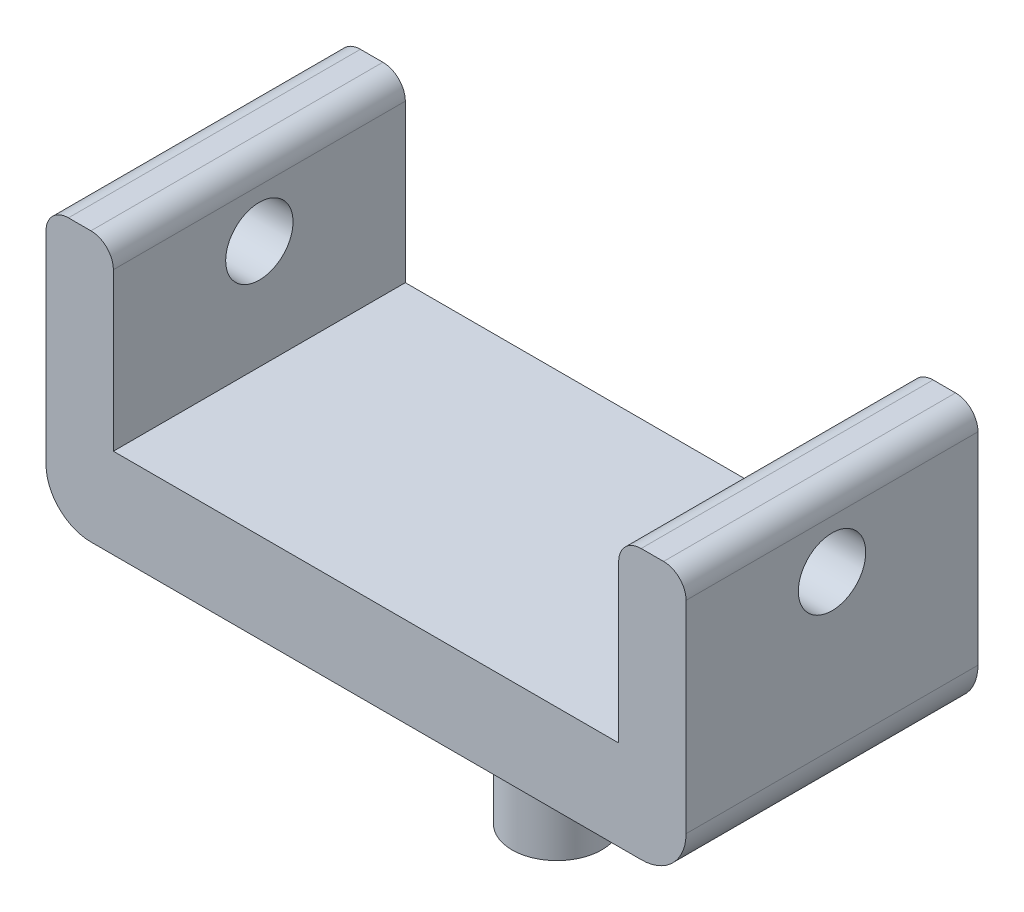
ISO-10303-21;
HEADER;
FILE_DESCRIPTION(('STEP AP214'),'2;1');
FILE_NAME('part.step','',(''),(''),'','','');
FILE_SCHEMA(('AUTOMOTIVE_DESIGN { 1 0 10303 214 1 1 1 1 }'));
ENDSEC;
DATA;
#1=APPLICATION_CONTEXT('core data for automotive mechanical design processes');
#2=APPLICATION_PROTOCOL_DEFINITION('international standard','automotive_design',2000,#1);
#3=PRODUCT_CONTEXT('',#1,'mechanical');
#4=PRODUCT('Part','Part','',(#3));
#5=PRODUCT_RELATED_PRODUCT_CATEGORY('part','',(#4));
#6=PRODUCT_DEFINITION_FORMATION('','',#4);
#7=PRODUCT_DEFINITION_CONTEXT('part definition',#1,'design');
#8=PRODUCT_DEFINITION('design','',#6,#7);
#9=PRODUCT_DEFINITION_SHAPE('','',#8);
#10=(LENGTH_UNIT() NAMED_UNIT(*) SI_UNIT(.MILLI.,.METRE.));
#11=(NAMED_UNIT(*) PLANE_ANGLE_UNIT() SI_UNIT($,.RADIAN.));
#12=(NAMED_UNIT(*) SI_UNIT($,.STERADIAN.) SOLID_ANGLE_UNIT());
#13=UNCERTAINTY_MEASURE_WITH_UNIT(LENGTH_MEASURE(1.E-05),#10,'distance_accuracy_value','');
#14=(GEOMETRIC_REPRESENTATION_CONTEXT(3) GLOBAL_UNCERTAINTY_ASSIGNED_CONTEXT((#13)) GLOBAL_UNIT_ASSIGNED_CONTEXT((#10,
#11,#12)) REPRESENTATION_CONTEXT('',''));
#15=CARTESIAN_POINT('',(0.,0.,0.));
#16=DIRECTION('',(0.,0.,1.));
#17=DIRECTION('',(1.,0.,0.));
#18=AXIS2_PLACEMENT_3D('',#15,#16,#17);
#19=CARTESIAN_POINT('',(0.,4.,0.));
#20=DIRECTION('',(0.,1.,0.));
#21=DIRECTION('',(0.,0.,1.));
#22=AXIS2_PLACEMENT_3D('',#19,#20,#21);
#23=PLANE('',#22);
#24=DIRECTION('',(1.,0.,0.));
#25=VECTOR('',#24,1.);
#26=CARTESIAN_POINT('',(0.,4.,-0.841162469478493));
#27=LINE('',#26,#25);
#28=CARTESIAN_POINT('',(-9.64718285128245,4.,-0.841162469478494));
#29=VERTEX_POINT('',#28);
#30=CARTESIAN_POINT('',(12.8528171487176,4.,-0.841162469478491));
#31=VERTEX_POINT('',#30);
#32=EDGE_CURVE('E266',#29,#31,#27,.T.);
#33=ORIENTED_EDGE('',*,*,#32,.F.);
#34=DIRECTION('',(0.,0.,-1.));
#35=VECTOR('',#34,1.);
#36=CARTESIAN_POINT('',(-9.64718285128245,4.,-4.84116246947849));
#37=LINE('',#36,#35);
#38=CARTESIAN_POINT('',(-9.64718285128245,4.,12.1588375305215));
#39=VERTEX_POINT('',#38);
#40=EDGE_CURVE('E214',#39,#29,#37,.T.);
#41=ORIENTED_EDGE('',*,*,#40,.F.);
#42=DIRECTION('',(1.,0.,0.));
#43=VECTOR('',#42,1.);
#44=CARTESIAN_POINT('',(-12.6471828512824,4.,12.1588375305215));
#45=LINE('',#44,#43);
#46=CARTESIAN_POINT('',(12.8528171487176,4.,12.1588375305215));
#47=VERTEX_POINT('',#46);
#48=EDGE_CURVE('E202',#39,#47,#45,.T.);
#49=ORIENTED_EDGE('',*,*,#48,.T.);
#50=DIRECTION('',(0.,0.,1.));
#51=VECTOR('',#50,1.);
#52=CARTESIAN_POINT('',(12.8528171487176,4.,-4.84116246947849));
#53=LINE('',#52,#51);
#54=EDGE_CURVE('E211',#31,#47,#53,.T.);
#55=ORIENTED_EDGE('',*,*,#54,.F.);
#56=EDGE_LOOP('',(#33,#41,#49,#55));
#57=FACE_BOUND('',#56,.T.);
#58=ADVANCED_FACE('F35',(#57),#23,.T.);
#59=CARTESIAN_POINT('',(-12.6471828512824,4.,-4.84116246947849));
#60=DIRECTION('',(1.,0.,0.));
#61=DIRECTION('',(0.,0.,-1.));
#62=AXIS2_PLACEMENT_3D('',#59,#60,#61);
#63=PLANE('',#62);
#64=CARTESIAN_POINT('',(-12.6471828512824,8.85,5.65883753052151));
#65=DIRECTION('',(-1.,0.,0.));
#66=DIRECTION('',(0.,0.,1.));
#67=AXIS2_PLACEMENT_3D('',#64,#65,#66);
#68=CIRCLE('',#67,1.5);
#69=CARTESIAN_POINT('',(-12.6471828512824,8.85,7.15883753052151));
#70=VERTEX_POINT('',#69);
#71=EDGE_CURVE('E277',#70,#70,#68,.T.);
#72=ORIENTED_EDGE('',*,*,#71,.F.);
#73=EDGE_LOOP('',(#72));
#74=FACE_BOUND('',#73,.T.);
#75=DIRECTION('',(0.,0.,1.));
#76=VECTOR('',#75,1.);
#77=CARTESIAN_POINT('',(-12.6471828512824,11.,-4.84116246947849));
#78=LINE('',#77,#76);
#79=CARTESIAN_POINT('',(-12.6471828512824,11.,12.1588375305215));
#80=VERTEX_POINT('',#79);
#81=CARTESIAN_POINT('',(-12.6471828512824,11.,-0.841162469478494));
#82=VERTEX_POINT('',#81);
#83=EDGE_CURVE('E172',#80,#82,#78,.F.);
#84=ORIENTED_EDGE('',*,*,#83,.T.);
#85=DIRECTION('',(0.,-1.,0.));
#86=VECTOR('',#85,1.);
#87=CARTESIAN_POINT('',(-12.6471828512824,4.,-0.841162469478495));
#88=LINE('',#87,#86);
#89=CARTESIAN_POINT('',(-12.6471828512824,2.,-0.841162469478495));
#90=VERTEX_POINT('',#89);
#91=EDGE_CURVE('E140',#82,#90,#88,.T.);
#92=ORIENTED_EDGE('',*,*,#91,.T.);
#93=DIRECTION('',(0.,0.,1.));
#94=VECTOR('',#93,1.);
#95=CARTESIAN_POINT('',(-12.6471828512824,2.,-4.84116246947849));
#96=LINE('',#95,#94);
#97=CARTESIAN_POINT('',(-12.6471828512824,2.,12.1588375305215));
#98=VERTEX_POINT('',#97);
#99=EDGE_CURVE('E243',#90,#98,#96,.T.);
#100=ORIENTED_EDGE('',*,*,#99,.T.);
#101=DIRECTION('',(0.,-1.,0.));
#102=VECTOR('',#101,1.);
#103=CARTESIAN_POINT('',(-12.6471828512824,4.,12.1588375305215));
#104=LINE('',#103,#102);
#105=EDGE_CURVE('E201',#80,#98,#104,.T.);
#106=ORIENTED_EDGE('',*,*,#105,.F.);
#107=EDGE_LOOP('',(#84,#92,#100,#106));
#108=FACE_BOUND('',#107,.T.);
#109=ADVANCED_FACE('F285',(#74,#108),#63,.F.);
#110=CARTESIAN_POINT('',(-12.6471828512824,4.,12.1588375305215));
#111=DIRECTION('',(0.,0.,-1.));
#112=DIRECTION('',(-1.,0.,0.));
#113=AXIS2_PLACEMENT_3D('',#110,#111,#112);
#114=PLANE('',#113);
#115=DIRECTION('',(1.,0.,0.));
#116=VECTOR('',#115,1.);
#117=CARTESIAN_POINT('',(-12.6471828512824,12.,12.1588375305215));
#118=LINE('',#117,#116);
#119=CARTESIAN_POINT('',(-11.6471828512824,12.,12.1588375305215));
#120=VERTEX_POINT('',#119);
#121=CARTESIAN_POINT('',(-10.6471828512824,12.,12.1588375305215));
#122=VERTEX_POINT('',#121);
#123=EDGE_CURVE('E221',#120,#122,#118,.T.);
#124=ORIENTED_EDGE('',*,*,#123,.F.);
#125=CARTESIAN_POINT('',(-11.6471828512824,11.,12.1588375305215));
#126=DIRECTION('',(0.,0.,-1.));
#127=DIRECTION('',(-1.,0.,0.));
#128=AXIS2_PLACEMENT_3D('',#125,#126,#127);
#129=CIRCLE('',#128,1.);
#130=EDGE_CURVE('E158',#120,#80,#129,.F.);
#131=ORIENTED_EDGE('',*,*,#130,.T.);
#132=ORIENTED_EDGE('',*,*,#105,.T.);
#133=CARTESIAN_POINT('',(-10.6471828512824,2.,12.1588375305215));
#134=DIRECTION('',(0.,0.,-1.));
#135=DIRECTION('',(-1.,0.,0.));
#136=AXIS2_PLACEMENT_3D('',#133,#134,#135);
#137=CIRCLE('',#136,2.);
#138=CARTESIAN_POINT('',(-10.6471828512824,0.,12.1588375305215));
#139=VERTEX_POINT('',#138);
#140=EDGE_CURVE('E246',#98,#139,#137,.F.);
#141=ORIENTED_EDGE('',*,*,#140,.T.);
#142=DIRECTION('',(1.,0.,0.));
#143=VECTOR('',#142,1.);
#144=CARTESIAN_POINT('',(-12.6471828512824,0.,12.1588375305215));
#145=LINE('',#144,#143);
#146=CARTESIAN_POINT('',(13.8528171487176,0.,12.1588375305215));
#147=VERTEX_POINT('',#146);
#148=EDGE_CURVE('E227',#139,#147,#145,.T.);
#149=ORIENTED_EDGE('',*,*,#148,.T.);
#150=CARTESIAN_POINT('',(13.8528171487176,2.,12.1588375305215));
#151=DIRECTION('',(0.,0.,-1.));
#152=DIRECTION('',(-1.,0.,0.));
#153=AXIS2_PLACEMENT_3D('',#150,#151,#152);
#154=CIRCLE('',#153,2.);
#155=CARTESIAN_POINT('',(15.8528171487176,2.,12.1588375305215));
#156=VERTEX_POINT('',#155);
#157=EDGE_CURVE('E199',#147,#156,#154,.F.);
#158=ORIENTED_EDGE('',*,*,#157,.T.);
#159=DIRECTION('',(0.,-1.,0.));
#160=VECTOR('',#159,1.);
#161=CARTESIAN_POINT('',(15.8528171487176,4.,12.1588375305215));
#162=LINE('',#161,#160);
#163=CARTESIAN_POINT('',(15.8528171487176,11.,12.1588375305215));
#164=VERTEX_POINT('',#163);
#165=EDGE_CURVE('E189',#164,#156,#162,.T.);
#166=ORIENTED_EDGE('',*,*,#165,.F.);
#167=CARTESIAN_POINT('',(14.8528171487176,11.,12.1588375305215));
#168=DIRECTION('',(0.,0.,-1.));
#169=DIRECTION('',(-1.,0.,0.));
#170=AXIS2_PLACEMENT_3D('',#167,#168,#169);
#171=CIRCLE('',#170,1.);
#172=CARTESIAN_POINT('',(14.8528171487176,12.,12.1588375305215));
#173=VERTEX_POINT('',#172);
#174=EDGE_CURVE('E160',#164,#173,#171,.F.);
#175=ORIENTED_EDGE('',*,*,#174,.T.);
#176=DIRECTION('',(1.,0.,0.));
#177=VECTOR('',#176,1.);
#178=CARTESIAN_POINT('',(15.8528171487176,12.,12.1588375305215));
#179=LINE('',#178,#177);
#180=CARTESIAN_POINT('',(13.8528171487176,12.,12.1588375305215));
#181=VERTEX_POINT('',#180);
#182=EDGE_CURVE('E208',#181,#173,#179,.T.);
#183=ORIENTED_EDGE('',*,*,#182,.F.);
#184=CARTESIAN_POINT('',(13.8528171487176,11.,12.1588375305215));
#185=DIRECTION('',(0.,0.,-1.));
#186=DIRECTION('',(-1.,0.,0.));
#187=AXIS2_PLACEMENT_3D('',#184,#185,#186);
#188=CIRCLE('',#187,1.);
#189=CARTESIAN_POINT('',(12.8528171487176,11.,12.1588375305215));
#190=VERTEX_POINT('',#189);
#191=EDGE_CURVE('E162',#181,#190,#188,.F.);
#192=ORIENTED_EDGE('',*,*,#191,.T.);
#193=DIRECTION('',(0.,-1.,0.));
#194=VECTOR('',#193,1.);
#195=CARTESIAN_POINT('',(12.8528171487176,12.,12.1588375305215));
#196=LINE('',#195,#194);
#197=EDGE_CURVE('E210',#190,#47,#196,.T.);
#198=ORIENTED_EDGE('',*,*,#197,.T.);
#199=ORIENTED_EDGE('',*,*,#48,.F.);
#200=DIRECTION('',(0.,-1.,0.));
#201=VECTOR('',#200,1.);
#202=CARTESIAN_POINT('',(-9.64718285128245,12.,12.1588375305215));
#203=LINE('',#202,#201);
#204=CARTESIAN_POINT('',(-9.64718285128245,11.,12.1588375305215));
#205=VERTEX_POINT('',#204);
#206=EDGE_CURVE('E223',#205,#39,#203,.T.);
#207=ORIENTED_EDGE('',*,*,#206,.F.);
#208=CARTESIAN_POINT('',(-10.6471828512824,11.,12.1588375305215));
#209=DIRECTION('',(0.,0.,-1.));
#210=DIRECTION('',(-1.,0.,0.));
#211=AXIS2_PLACEMENT_3D('',#208,#209,#210);
#212=CIRCLE('',#211,1.);
#213=EDGE_CURVE('E169',#205,#122,#212,.F.);
#214=ORIENTED_EDGE('',*,*,#213,.T.);
#215=EDGE_LOOP('',(#124,#131,#132,#141,#149,#158,#166,#175,#183,#192,#198,#199,#207,#214));
#216=FACE_BOUND('',#215,.T.);
#217=ADVANCED_FACE('F194',(#216),#114,.F.);
#218=CARTESIAN_POINT('',(15.8528171487176,4.,-4.84116246947849));
#219=DIRECTION('',(1.,0.,0.));
#220=DIRECTION('',(0.,0.,-1.));
#221=AXIS2_PLACEMENT_3D('',#218,#219,#220);
#222=PLANE('',#221);
#223=DIRECTION('',(0.,-1.,0.));
#224=VECTOR('',#223,1.);
#225=CARTESIAN_POINT('',(15.8528171487176,4.,-0.841162469478491));
#226=LINE('',#225,#224);
#227=CARTESIAN_POINT('',(15.8528171487176,11.,-0.841162469478491));
#228=VERTEX_POINT('',#227);
#229=CARTESIAN_POINT('',(15.8528171487176,2.,-0.841162469478491));
#230=VERTEX_POINT('',#229);
#231=EDGE_CURVE('E155',#228,#230,#226,.T.);
#232=ORIENTED_EDGE('',*,*,#231,.F.);
#233=DIRECTION('',(0.,0.,-1.));
#234=VECTOR('',#233,1.);
#235=CARTESIAN_POINT('',(15.8528171487176,11.,12.1588375305215));
#236=LINE('',#235,#234);
#237=EDGE_CURVE('E43',#228,#164,#236,.F.);
#238=ORIENTED_EDGE('',*,*,#237,.T.);
#239=ORIENTED_EDGE('',*,*,#165,.T.);
#240=DIRECTION('',(0.,0.,1.));
#241=VECTOR('',#240,1.);
#242=CARTESIAN_POINT('',(15.8528171487176,2.,-4.84116246947849));
#243=LINE('',#242,#241);
#244=EDGE_CURVE('E164',#156,#230,#243,.F.);
#245=ORIENTED_EDGE('',*,*,#244,.T.);
#246=EDGE_LOOP('',(#232,#238,#239,#245));
#247=FACE_BOUND('',#246,.T.);
#248=CARTESIAN_POINT('',(15.8528171487176,8.85,5.65883753052151));
#249=DIRECTION('',(-1.,0.,0.));
#250=DIRECTION('',(0.,0.,1.));
#251=AXIS2_PLACEMENT_3D('',#248,#249,#250);
#252=CIRCLE('',#251,1.5);
#253=CARTESIAN_POINT('',(15.8528171487176,8.85,7.15883753052151));
#254=VERTEX_POINT('',#253);
#255=EDGE_CURVE('E237',#254,#254,#252,.T.);
#256=ORIENTED_EDGE('',*,*,#255,.T.);
#257=EDGE_LOOP('',(#256));
#258=FACE_BOUND('',#257,.T.);
#259=ADVANCED_FACE('F186',(#247,#258),#222,.T.);
#260=CARTESIAN_POINT('',(0.,0.,0.));
#261=DIRECTION('',(0.,1.,0.));
#262=DIRECTION('',(0.,0.,1.));
#263=AXIS2_PLACEMENT_3D('',#260,#261,#262);
#264=PLANE('',#263);
#265=CARTESIAN_POINT('',(1.60281714871756,0.,3.65883753052151));
#266=DIRECTION('',(0.,1.,0.));
#267=DIRECTION('',(0.,0.,1.));
#268=AXIS2_PLACEMENT_3D('',#265,#266,#267);
#269=CIRCLE('',#268,4.);
#270=CARTESIAN_POINT('',(1.60281714871756,0.,7.65883753052151));
#271=VERTEX_POINT('',#270);
#272=EDGE_CURVE('E240',#271,#271,#269,.T.);
#273=ORIENTED_EDGE('',*,*,#272,.T.);
#274=EDGE_LOOP('',(#273));
#275=FACE_BOUND('',#274,.T.);
#276=DIRECTION('',(0.,0.,1.));
#277=VECTOR('',#276,1.);
#278=CARTESIAN_POINT('',(-10.6471828512824,0.,0.));
#279=LINE('',#278,#277);
#280=CARTESIAN_POINT('',(-10.6471828512824,0.,-0.841162469478494));
#281=VERTEX_POINT('',#280);
#282=EDGE_CURVE('E250',#139,#281,#279,.F.);
#283=ORIENTED_EDGE('',*,*,#282,.T.);
#284=DIRECTION('',(-1.,0.,0.));
#285=VECTOR('',#284,1.);
#286=CARTESIAN_POINT('',(19.4592429780123,0.,-0.84116246947849));
#287=LINE('',#286,#285);
#288=CARTESIAN_POINT('',(13.8528171487176,0.,-0.841162469478491));
#289=VERTEX_POINT('',#288);
#290=EDGE_CURVE('E299',#289,#281,#287,.T.);
#291=ORIENTED_EDGE('',*,*,#290,.F.);
#292=DIRECTION('',(0.,0.,1.));
#293=VECTOR('',#292,1.);
#294=CARTESIAN_POINT('',(13.8528171487176,0.,12.1588375305215));
#295=LINE('',#294,#293);
#296=EDGE_CURVE('E248',#289,#147,#295,.T.);
#297=ORIENTED_EDGE('',*,*,#296,.T.);
#298=ORIENTED_EDGE('',*,*,#148,.F.);
#299=EDGE_LOOP('',(#283,#291,#297,#298));
#300=FACE_BOUND('',#299,.T.);
#301=ADVANCED_FACE('F298',(#275,#300),#264,.F.);
#302=CARTESIAN_POINT('',(-9.64718285128245,12.,-4.84116246947849));
#303=DIRECTION('',(-1.,0.,0.));
#304=DIRECTION('',(0.,0.,1.));
#305=AXIS2_PLACEMENT_3D('',#302,#303,#304);
#306=PLANE('',#305);
#307=CARTESIAN_POINT('',(-9.64718285128245,8.85,5.65883753052151));
#308=DIRECTION('',(-1.,0.,0.));
#309=DIRECTION('',(0.,0.,1.));
#310=AXIS2_PLACEMENT_3D('',#307,#308,#309);
#311=CIRCLE('',#310,1.5);
#312=CARTESIAN_POINT('',(-9.64718285128245,8.85,7.15883753052151));
#313=VERTEX_POINT('',#312);
#314=EDGE_CURVE('E216',#313,#313,#311,.T.);
#315=ORIENTED_EDGE('',*,*,#314,.T.);
#316=EDGE_LOOP('',(#315));
#317=FACE_BOUND('',#316,.T.);
#318=ORIENTED_EDGE('',*,*,#40,.T.);
#319=DIRECTION('',(0.,1.,0.));
#320=VECTOR('',#319,1.);
#321=CARTESIAN_POINT('',(-9.64718285128245,12.,-0.841162469478494));
#322=LINE('',#321,#320);
#323=CARTESIAN_POINT('',(-9.64718285128245,11.,-0.841162469478494));
#324=VERTEX_POINT('',#323);
#325=EDGE_CURVE('E268',#29,#324,#322,.T.);
#326=ORIENTED_EDGE('',*,*,#325,.T.);
#327=DIRECTION('',(0.,0.,-1.));
#328=VECTOR('',#327,1.);
#329=CARTESIAN_POINT('',(-9.64718285128245,11.,12.1588375305215));
#330=LINE('',#329,#328);
#331=EDGE_CURVE('E57',#324,#205,#330,.F.);
#332=ORIENTED_EDGE('',*,*,#331,.T.);
#333=ORIENTED_EDGE('',*,*,#206,.T.);
#334=EDGE_LOOP('',(#318,#326,#332,#333));
#335=FACE_BOUND('',#334,.T.);
#336=ADVANCED_FACE('F302',(#317,#335),#306,.F.);
#337=CARTESIAN_POINT('',(0.,12.,0.));
#338=DIRECTION('',(0.,1.,0.));
#339=DIRECTION('',(0.,0.,1.));
#340=AXIS2_PLACEMENT_3D('',#337,#338,#339);
#341=PLANE('',#340);
#342=DIRECTION('',(1.,0.,0.));
#343=VECTOR('',#342,1.);
#344=CARTESIAN_POINT('',(19.4592429780123,12.,-0.84116246947849));
#345=LINE('',#344,#343);
#346=CARTESIAN_POINT('',(-11.6471828512824,12.,-0.841162469478494));
#347=VERTEX_POINT('',#346);
#348=CARTESIAN_POINT('',(-10.6471828512824,12.,-0.841162469478494));
#349=VERTEX_POINT('',#348);
#350=EDGE_CURVE('E137',#347,#349,#345,.T.);
#351=ORIENTED_EDGE('',*,*,#350,.F.);
#352=DIRECTION('',(0.,0.,1.));
#353=VECTOR('',#352,1.);
#354=CARTESIAN_POINT('',(-11.6471828512824,12.,12.1588375305215));
#355=LINE('',#354,#353);
#356=EDGE_CURVE('E151',#347,#120,#355,.T.);
#357=ORIENTED_EDGE('',*,*,#356,.T.);
#358=ORIENTED_EDGE('',*,*,#123,.T.);
#359=DIRECTION('',(0.,0.,-1.));
#360=VECTOR('',#359,1.);
#361=CARTESIAN_POINT('',(-10.6471828512824,12.,-4.84116246947849));
#362=LINE('',#361,#360);
#363=EDGE_CURVE('E154',#122,#349,#362,.T.);
#364=ORIENTED_EDGE('',*,*,#363,.T.);
#365=EDGE_LOOP('',(#351,#357,#358,#364));
#366=FACE_BOUND('',#365,.T.);
#367=ADVANCED_FACE('F149',(#366),#341,.T.);
#368=CARTESIAN_POINT('',(12.8528171487176,12.,-4.84116246947849));
#369=DIRECTION('',(1.,0.,0.));
#370=DIRECTION('',(0.,0.,-1.));
#371=AXIS2_PLACEMENT_3D('',#368,#369,#370);
#372=PLANE('',#371);
#373=CARTESIAN_POINT('',(12.8528171487176,8.85,5.65883753052151));
#374=DIRECTION('',(1.,0.,0.));
#375=DIRECTION('',(0.,0.,-1.));
#376=AXIS2_PLACEMENT_3D('',#373,#374,#375);
#377=CIRCLE('',#376,1.5);
#378=CARTESIAN_POINT('',(12.8528171487176,8.85,4.15883753052151));
#379=VERTEX_POINT('',#378);
#380=EDGE_CURVE('E234',#379,#379,#377,.T.);
#381=ORIENTED_EDGE('',*,*,#380,.T.);
#382=EDGE_LOOP('',(#381));
#383=FACE_BOUND('',#382,.T.);
#384=DIRECTION('',(0.,0.,1.));
#385=VECTOR('',#384,1.);
#386=CARTESIAN_POINT('',(12.8528171487176,11.,-4.84116246947849));
#387=LINE('',#386,#385);
#388=CARTESIAN_POINT('',(12.8528171487176,11.,-0.841162469478491));
#389=VERTEX_POINT('',#388);
#390=EDGE_CURVE('E180',#190,#389,#387,.F.);
#391=ORIENTED_EDGE('',*,*,#390,.T.);
#392=DIRECTION('',(0.,-1.,0.));
#393=VECTOR('',#392,1.);
#394=CARTESIAN_POINT('',(12.8528171487176,12.,-0.841162469478491));
#395=LINE('',#394,#393);
#396=EDGE_CURVE('E260',#389,#31,#395,.T.);
#397=ORIENTED_EDGE('',*,*,#396,.T.);
#398=ORIENTED_EDGE('',*,*,#54,.T.);
#399=ORIENTED_EDGE('',*,*,#197,.F.);
#400=EDGE_LOOP('',(#391,#397,#398,#399));
#401=FACE_BOUND('',#400,.T.);
#402=ADVANCED_FACE('F321',(#383,#401),#372,.F.);
#403=CARTESIAN_POINT('',(0.,12.,0.));
#404=DIRECTION('',(0.,-1.,0.));
#405=DIRECTION('',(0.,0.,-1.));
#406=AXIS2_PLACEMENT_3D('',#403,#404,#405);
#407=PLANE('',#406);
#408=DIRECTION('',(0.,0.,-1.));
#409=VECTOR('',#408,1.);
#410=CARTESIAN_POINT('',(14.8528171487176,12.,-4.84116246947849));
#411=LINE('',#410,#409);
#412=CARTESIAN_POINT('',(14.8528171487176,12.,-0.841162469478493));
#413=VERTEX_POINT('',#412);
#414=EDGE_CURVE('E175',#173,#413,#411,.T.);
#415=ORIENTED_EDGE('',*,*,#414,.T.);
#416=CARTESIAN_POINT('',(13.8528171487176,12.,-0.841162469478491));
#417=VERTEX_POINT('',#416);
#418=EDGE_CURVE('E49',#417,#413,#345,.T.);
#419=ORIENTED_EDGE('',*,*,#418,.F.);
#420=DIRECTION('',(0.,0.,1.));
#421=VECTOR('',#420,1.);
#422=CARTESIAN_POINT('',(13.8528171487176,12.,0.));
#423=LINE('',#422,#421);
#424=EDGE_CURVE('E178',#417,#181,#423,.T.);
#425=ORIENTED_EDGE('',*,*,#424,.T.);
#426=ORIENTED_EDGE('',*,*,#182,.T.);
#427=EDGE_LOOP('',(#415,#419,#425,#426));
#428=FACE_BOUND('',#427,.T.);
#429=ADVANCED_FACE('F206',(#428),#407,.F.);
#430=CARTESIAN_POINT('',(15.8528171487176,8.85,5.65883753052151));
#431=DIRECTION('',(-1.,0.,0.));
#432=DIRECTION('',(0.,0.,1.));
#433=AXIS2_PLACEMENT_3D('',#430,#431,#432);
#434=CYLINDRICAL_SURFACE('',#433,1.5);
#435=ORIENTED_EDGE('',*,*,#255,.F.);
#436=EDGE_LOOP('',(#435));
#437=FACE_BOUND('',#436,.T.);
#438=ORIENTED_EDGE('',*,*,#380,.F.);
#439=EDGE_LOOP('',(#438));
#440=FACE_BOUND('',#439,.T.);
#441=ADVANCED_FACE('F327',(#437,#440),#434,.F.);
#442=ORIENTED_EDGE('',*,*,#71,.T.);
#443=EDGE_LOOP('',(#442));
#444=FACE_BOUND('',#443,.T.);
#445=ORIENTED_EDGE('',*,*,#314,.F.);
#446=EDGE_LOOP('',(#445));
#447=FACE_BOUND('',#446,.T.);
#448=ADVANCED_FACE('F282',(#444,#447),#434,.F.);
#449=CARTESIAN_POINT('',(1.60281714871756,-9.,3.65883753052151));
#450=DIRECTION('',(0.,1.,0.));
#451=DIRECTION('',(0.,0.,1.));
#452=AXIS2_PLACEMENT_3D('',#449,#450,#451);
#453=CYLINDRICAL_SURFACE('',#452,2.);
#454=CARTESIAN_POINT('',(1.60281714871756,-2.,3.65883753052151));
#455=DIRECTION('',(0.,1.,0.));
#456=DIRECTION('',(0.,0.,1.));
#457=AXIS2_PLACEMENT_3D('',#454,#455,#456);
#458=CIRCLE('',#457,2.);
#459=CARTESIAN_POINT('',(1.60281714871756,-2.,5.65883753052151));
#460=VERTEX_POINT('',#459);
#461=EDGE_CURVE('E233',#460,#460,#458,.F.);
#462=ORIENTED_EDGE('',*,*,#461,.T.);
#463=EDGE_LOOP('',(#462));
#464=FACE_BOUND('',#463,.T.);
#465=CARTESIAN_POINT('',(1.60281714871756,-9.,3.65883753052151));
#466=DIRECTION('',(0.,-1.,0.));
#467=DIRECTION('',(0.,0.,-1.));
#468=AXIS2_PLACEMENT_3D('',#465,#466,#467);
#469=CIRCLE('',#468,2.);
#470=CARTESIAN_POINT('',(1.60281714871756,-9.,1.65883753052151));
#471=VERTEX_POINT('',#470);
#472=EDGE_CURVE('E274',#471,#471,#469,.T.);
#473=ORIENTED_EDGE('',*,*,#472,.F.);
#474=EDGE_LOOP('',(#473));
#475=FACE_BOUND('',#474,.T.);
#476=ADVANCED_FACE('F330',(#464,#475),#453,.T.);
#477=CARTESIAN_POINT('',(1.60281714871756,-9.,3.65883753052151));
#478=DIRECTION('',(0.,-1.,0.));
#479=DIRECTION('',(0.,0.,-1.));
#480=AXIS2_PLACEMENT_3D('',#477,#478,#479);
#481=PLANE('',#480);
#482=ORIENTED_EDGE('',*,*,#472,.T.);
#483=EDGE_LOOP('',(#482));
#484=FACE_BOUND('',#483,.T.);
#485=ADVANCED_FACE('F333',(#484),#481,.T.);
#486=CARTESIAN_POINT('',(1.60281714871756,-2.,3.65883753052151));
#487=DIRECTION('',(0.,1.,0.));
#488=DIRECTION('',(0.,0.,1.));
#489=AXIS2_PLACEMENT_3D('',#486,#487,#488);
#490=TOROIDAL_SURFACE('',#489,4.,2.);
#491=ORIENTED_EDGE('',*,*,#272,.F.);
#492=EDGE_LOOP('',(#491));
#493=FACE_BOUND('',#492,.T.);
#494=ORIENTED_EDGE('',*,*,#461,.F.);
#495=EDGE_LOOP('',(#494));
#496=FACE_BOUND('',#495,.T.);
#497=ADVANCED_FACE('F337',(#493,#496),#490,.F.);
#498=CARTESIAN_POINT('',(-10.6471828512824,2.,-4.84116246947849));
#499=DIRECTION('',(0.,0.,1.));
#500=DIRECTION('',(1.,0.,0.));
#501=AXIS2_PLACEMENT_3D('',#498,#499,#500);
#502=CYLINDRICAL_SURFACE('',#501,2.);
#503=CARTESIAN_POINT('',(-10.6471828512824,2.,-0.841162469478495));
#504=DIRECTION('',(0.,0.,1.));
#505=DIRECTION('',(1.,0.,0.));
#506=AXIS2_PLACEMENT_3D('',#503,#504,#505);
#507=CIRCLE('',#506,2.);
#508=EDGE_CURVE('E272',#281,#90,#507,.F.);
#509=ORIENTED_EDGE('',*,*,#508,.F.);
#510=ORIENTED_EDGE('',*,*,#282,.F.);
#511=ORIENTED_EDGE('',*,*,#140,.F.);
#512=ORIENTED_EDGE('',*,*,#99,.F.);
#513=EDGE_LOOP('',(#509,#510,#511,#512));
#514=FACE_BOUND('',#513,.T.);
#515=ADVANCED_FACE('F296',(#514),#502,.T.);
#516=CARTESIAN_POINT('',(13.8528171487176,2.,0.));
#517=DIRECTION('',(0.,0.,-1.));
#518=DIRECTION('',(-1.,0.,0.));
#519=AXIS2_PLACEMENT_3D('',#516,#517,#518);
#520=CYLINDRICAL_SURFACE('',#519,2.);
#521=CARTESIAN_POINT('',(13.8528171487176,2.,-0.841162469478491));
#522=DIRECTION('',(0.,0.,1.));
#523=DIRECTION('',(1.,0.,0.));
#524=AXIS2_PLACEMENT_3D('',#521,#522,#523);
#525=CIRCLE('',#524,2.);
#526=EDGE_CURVE('E256',#230,#289,#525,.F.);
#527=ORIENTED_EDGE('',*,*,#526,.F.);
#528=ORIENTED_EDGE('',*,*,#244,.F.);
#529=ORIENTED_EDGE('',*,*,#157,.F.);
#530=ORIENTED_EDGE('',*,*,#296,.F.);
#531=EDGE_LOOP('',(#527,#528,#529,#530));
#532=FACE_BOUND('',#531,.T.);
#533=ADVANCED_FACE('F254',(#532),#520,.T.);
#534=CARTESIAN_POINT('',(-11.6471828512824,11.,0.));
#535=DIRECTION('',(0.,0.,-1.));
#536=DIRECTION('',(-1.,0.,0.));
#537=AXIS2_PLACEMENT_3D('',#534,#535,#536);
#538=CYLINDRICAL_SURFACE('',#537,1.);
#539=CARTESIAN_POINT('',(-11.6471828512824,11.,-0.841162469478494));
#540=DIRECTION('',(0.,0.,1.));
#541=DIRECTION('',(1.,0.,0.));
#542=AXIS2_PLACEMENT_3D('',#539,#540,#541);
#543=CIRCLE('',#542,1.);
#544=EDGE_CURVE('E134',#82,#347,#543,.F.);
#545=ORIENTED_EDGE('',*,*,#544,.F.);
#546=ORIENTED_EDGE('',*,*,#83,.F.);
#547=ORIENTED_EDGE('',*,*,#130,.F.);
#548=ORIENTED_EDGE('',*,*,#356,.F.);
#549=EDGE_LOOP('',(#545,#546,#547,#548));
#550=FACE_BOUND('',#549,.T.);
#551=ADVANCED_FACE('F157',(#550),#538,.T.);
#552=CARTESIAN_POINT('',(-10.6471828512824,11.,0.));
#553=DIRECTION('',(0.,0.,1.));
#554=DIRECTION('',(1.,0.,0.));
#555=AXIS2_PLACEMENT_3D('',#552,#553,#554);
#556=CYLINDRICAL_SURFACE('',#555,1.);
#557=CARTESIAN_POINT('',(-10.6471828512824,11.,-0.841162469478494));
#558=DIRECTION('',(0.,0.,1.));
#559=DIRECTION('',(1.,0.,0.));
#560=AXIS2_PLACEMENT_3D('',#557,#558,#559);
#561=CIRCLE('',#560,1.);
#562=EDGE_CURVE('E145',#349,#324,#561,.F.);
#563=ORIENTED_EDGE('',*,*,#562,.F.);
#564=ORIENTED_EDGE('',*,*,#363,.F.);
#565=ORIENTED_EDGE('',*,*,#213,.F.);
#566=ORIENTED_EDGE('',*,*,#331,.F.);
#567=EDGE_LOOP('',(#563,#564,#565,#566));
#568=FACE_BOUND('',#567,.T.);
#569=ADVANCED_FACE('F347',(#568),#556,.T.);
#570=CARTESIAN_POINT('',(13.8528171487176,11.,0.));
#571=DIRECTION('',(0.,0.,1.));
#572=DIRECTION('',(1.,0.,0.));
#573=AXIS2_PLACEMENT_3D('',#570,#571,#572);
#574=CYLINDRICAL_SURFACE('',#573,1.);
#575=CARTESIAN_POINT('',(13.8528171487176,11.,-0.841162469478491));
#576=DIRECTION('',(0.,0.,1.));
#577=DIRECTION('',(1.,0.,0.));
#578=AXIS2_PLACEMENT_3D('',#575,#576,#577);
#579=CIRCLE('',#578,1.);
#580=EDGE_CURVE('E258',#389,#417,#579,.F.);
#581=ORIENTED_EDGE('',*,*,#580,.F.);
#582=ORIENTED_EDGE('',*,*,#390,.F.);
#583=ORIENTED_EDGE('',*,*,#191,.F.);
#584=ORIENTED_EDGE('',*,*,#424,.F.);
#585=EDGE_LOOP('',(#581,#582,#583,#584));
#586=FACE_BOUND('',#585,.T.);
#587=ADVANCED_FACE('F343',(#586),#574,.T.);
#588=CARTESIAN_POINT('',(14.8528171487176,11.,0.));
#589=DIRECTION('',(0.,0.,1.));
#590=DIRECTION('',(1.,0.,0.));
#591=AXIS2_PLACEMENT_3D('',#588,#589,#590);
#592=CYLINDRICAL_SURFACE('',#591,1.);
#593=CARTESIAN_POINT('',(14.8528171487176,11.,-0.841162469478491));
#594=DIRECTION('',(0.,0.,1.));
#595=DIRECTION('',(1.,0.,0.));
#596=AXIS2_PLACEMENT_3D('',#593,#594,#595);
#597=CIRCLE('',#596,1.);
#598=EDGE_CURVE('E11',#413,#228,#597,.F.);
#599=ORIENTED_EDGE('',*,*,#598,.F.);
#600=ORIENTED_EDGE('',*,*,#414,.F.);
#601=ORIENTED_EDGE('',*,*,#174,.F.);
#602=ORIENTED_EDGE('',*,*,#237,.F.);
#603=EDGE_LOOP('',(#599,#600,#601,#602));
#604=FACE_BOUND('',#603,.T.);
#605=ADVANCED_FACE('F37',(#604),#592,.T.);
#606=CARTESIAN_POINT('',(19.4592429780123,49.3457116957132,-0.84116246947849));
#607=DIRECTION('',(0.,0.,1.));
#608=DIRECTION('',(1.,0.,0.));
#609=AXIS2_PLACEMENT_3D('',#606,#607,#608);
#610=PLANE('',#609);
#611=ORIENTED_EDGE('',*,*,#508,.T.);
#612=ORIENTED_EDGE('',*,*,#91,.F.);
#613=ORIENTED_EDGE('',*,*,#544,.T.);
#614=ORIENTED_EDGE('',*,*,#350,.T.);
#615=ORIENTED_EDGE('',*,*,#562,.T.);
#616=ORIENTED_EDGE('',*,*,#325,.F.);
#617=ORIENTED_EDGE('',*,*,#32,.T.);
#618=ORIENTED_EDGE('',*,*,#396,.F.);
#619=ORIENTED_EDGE('',*,*,#580,.T.);
#620=ORIENTED_EDGE('',*,*,#418,.T.);
#621=ORIENTED_EDGE('',*,*,#598,.T.);
#622=ORIENTED_EDGE('',*,*,#231,.T.);
#623=ORIENTED_EDGE('',*,*,#526,.T.);
#624=ORIENTED_EDGE('',*,*,#290,.T.);
#625=EDGE_LOOP('',(#611,#612,#613,#614,#615,#616,#617,#618,#619,#620,#621,#622,#623,#624));
#626=FACE_BOUND('',#625,.T.);
#627=ADVANCED_FACE('F136',(#626),#610,.F.);
#628=CLOSED_SHELL('',(#58,#109,#217,#259,#301,#336,#367,#402,#429,#441,#448,#476,#485,#497,#515,
#533,#551,#569,#587,#605,#627));
#629=MANIFOLD_SOLID_BREP('B2',#628);
#630=ADVANCED_BREP_SHAPE_REPRESENTATION('',(#18,#629),#14);
#631=SHAPE_DEFINITION_REPRESENTATION(#9,#630);
ENDSEC;
END-ISO-10303-21;
